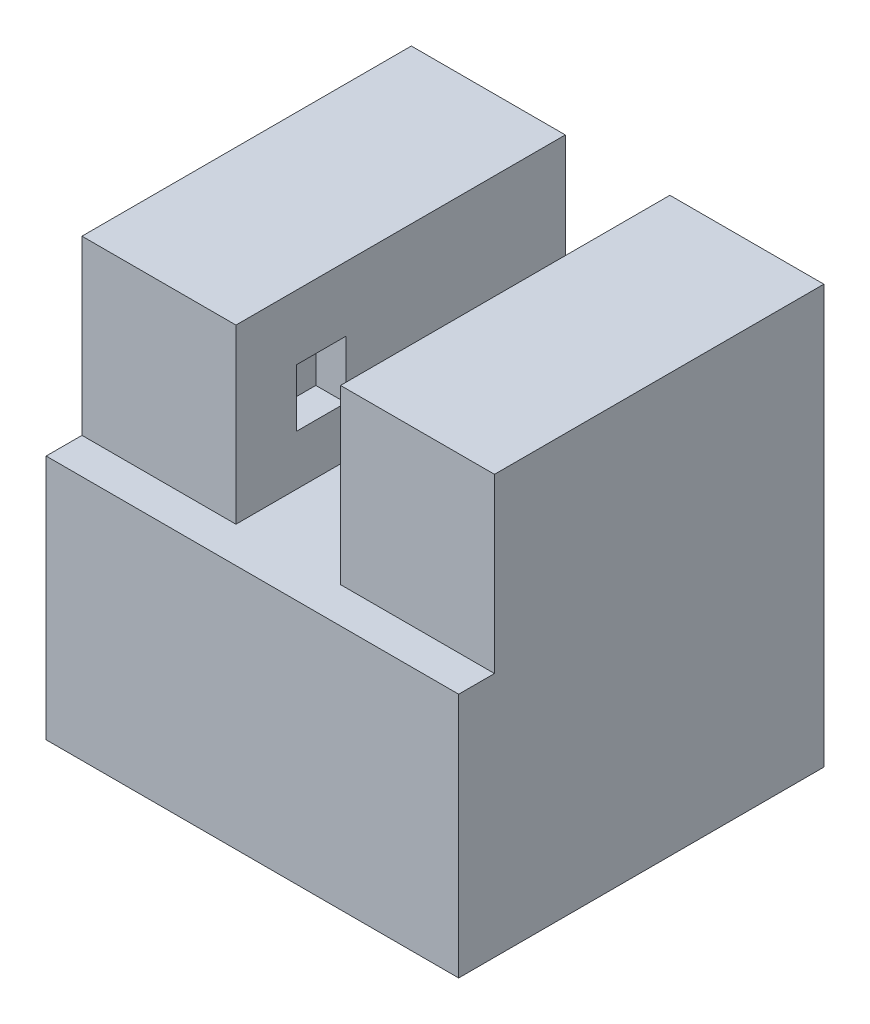
ISO-10303-21;
HEADER;
FILE_DESCRIPTION(('STEP AP214'),'2;1');
FILE_NAME('part.step','',(''),(''),'','','');
FILE_SCHEMA(('AUTOMOTIVE_DESIGN { 1 0 10303 214 1 1 1 1 }'));
ENDSEC;
DATA;
#1=APPLICATION_CONTEXT('core data for automotive mechanical design processes');
#2=APPLICATION_PROTOCOL_DEFINITION('international standard','automotive_design',2000,#1);
#3=PRODUCT_CONTEXT('',#1,'mechanical');
#4=PRODUCT('Part','Part','',(#3));
#5=PRODUCT_RELATED_PRODUCT_CATEGORY('part','',(#4));
#6=PRODUCT_DEFINITION_FORMATION('','',#4);
#7=PRODUCT_DEFINITION_CONTEXT('part definition',#1,'design');
#8=PRODUCT_DEFINITION('design','',#6,#7);
#9=PRODUCT_DEFINITION_SHAPE('','',#8);
#10=(LENGTH_UNIT() NAMED_UNIT(*) SI_UNIT(.MILLI.,.METRE.));
#11=(NAMED_UNIT(*) PLANE_ANGLE_UNIT() SI_UNIT($,.RADIAN.));
#12=(NAMED_UNIT(*) SI_UNIT($,.STERADIAN.) SOLID_ANGLE_UNIT());
#13=UNCERTAINTY_MEASURE_WITH_UNIT(LENGTH_MEASURE(1.E-05),#10,'distance_accuracy_value','');
#14=(GEOMETRIC_REPRESENTATION_CONTEXT(3) GLOBAL_UNCERTAINTY_ASSIGNED_CONTEXT((#13)) GLOBAL_UNIT_ASSIGNED_CONTEXT((#10,
#11,#12)) REPRESENTATION_CONTEXT('',''));
#15=CARTESIAN_POINT('',(0.,0.,0.));
#16=DIRECTION('',(0.,0.,1.));
#17=DIRECTION('',(1.,0.,0.));
#18=AXIS2_PLACEMENT_3D('',#15,#16,#17);
#19=CARTESIAN_POINT('',(-9.35,25.4,10.));
#20=DIRECTION('',(0.,0.,-1.));
#21=DIRECTION('',(-1.,0.,0.));
#22=AXIS2_PLACEMENT_3D('',#19,#20,#21);
#23=PLANE('',#22);
#24=DIRECTION('',(0.,-1.,0.));
#25=VECTOR('',#24,1.);
#26=CARTESIAN_POINT('',(-12.525,25.4,10.));
#27=LINE('',#26,#25);
#28=CARTESIAN_POINT('',(-12.525,25.4,10.));
#29=VERTEX_POINT('',#28);
#30=CARTESIAN_POINT('',(-12.525,14.925,10.));
#31=VERTEX_POINT('',#30);
#32=EDGE_CURVE('E403',#29,#31,#27,.T.);
#33=ORIENTED_EDGE('',*,*,#32,.T.);
#34=DIRECTION('',(1.,0.,0.));
#35=VECTOR('',#34,1.);
#36=CARTESIAN_POINT('',(-27.6076473140493,14.925,10.));
#37=LINE('',#36,#35);
#38=CARTESIAN_POINT('',(-3.175,14.925,10.));
#39=VERTEX_POINT('',#38);
#40=EDGE_CURVE('E44',#31,#39,#37,.T.);
#41=ORIENTED_EDGE('',*,*,#40,.T.);
#42=DIRECTION('',(0.,-1.,0.));
#43=VECTOR('',#42,1.);
#44=CARTESIAN_POINT('',(-3.175,0.,10.));
#45=LINE('',#44,#43);
#46=CARTESIAN_POINT('',(-3.175,25.4,10.));
#47=VERTEX_POINT('',#46);
#48=EDGE_CURVE('E423',#47,#39,#45,.T.);
#49=ORIENTED_EDGE('',*,*,#48,.F.);
#50=DIRECTION('',(1.,0.,0.));
#51=VECTOR('',#50,1.);
#52=CARTESIAN_POINT('',(-9.35,25.4,10.));
#53=LINE('',#52,#51);
#54=EDGE_CURVE('E446',#29,#47,#53,.T.);
#55=ORIENTED_EDGE('',*,*,#54,.F.);
#56=EDGE_LOOP('',(#33,#41,#49,#55));
#57=FACE_BOUND('',#56,.T.);
#58=ADVANCED_FACE('F33',(#57),#23,.F.);
#59=CARTESIAN_POINT('',(0.,0.,6.825));
#60=DIRECTION('',(0.,0.,-1.));
#61=DIRECTION('',(-1.,0.,0.));
#62=AXIS2_PLACEMENT_3D('',#59,#60,#61);
#63=PLANE('',#62);
#64=DIRECTION('',(1.,0.,0.));
#65=VECTOR('',#64,1.);
#66=CARTESIAN_POINT('',(0.,10.125,6.825));
#67=LINE('',#66,#65);
#68=CARTESIAN_POINT('',(-9.35,10.125,6.825));
#69=VERTEX_POINT('',#68);
#70=CARTESIAN_POINT('',(-5.,10.125,6.825));
#71=VERTEX_POINT('',#70);
#72=EDGE_CURVE('E42',#69,#71,#67,.T.);
#73=ORIENTED_EDGE('',*,*,#72,.F.);
#74=DIRECTION('',(0.,1.,0.));
#75=VECTOR('',#74,1.);
#76=CARTESIAN_POINT('',(-9.35,0.,6.825));
#77=LINE('',#76,#75);
#78=CARTESIAN_POINT('',(-9.35,22.225,6.825));
#79=VERTEX_POINT('',#78);
#80=EDGE_CURVE('E366',#69,#79,#77,.T.);
#81=ORIENTED_EDGE('',*,*,#80,.T.);
#82=DIRECTION('',(1.,0.,0.));
#83=VECTOR('',#82,1.);
#84=CARTESIAN_POINT('',(0.,22.225,6.825));
#85=LINE('',#84,#83);
#86=CARTESIAN_POINT('',(-5.,22.225,6.825));
#87=VERTEX_POINT('',#86);
#88=EDGE_CURVE('E368',#79,#87,#85,.T.);
#89=ORIENTED_EDGE('',*,*,#88,.T.);
#90=DIRECTION('',(0.,1.,0.));
#91=VECTOR('',#90,1.);
#92=CARTESIAN_POINT('',(-5.,0.,6.825));
#93=LINE('',#92,#91);
#94=EDGE_CURVE('E355',#71,#87,#93,.T.);
#95=ORIENTED_EDGE('',*,*,#94,.F.);
#96=EDGE_LOOP('',(#73,#81,#89,#95));
#97=FACE_BOUND('',#96,.T.);
#98=ADVANCED_FACE('F528',(#97),#63,.T.);
#99=DIRECTION('',(0.,-1.,0.));
#100=VECTOR('',#99,1.);
#101=CARTESIAN_POINT('',(3.175,0.,10.));
#102=LINE('',#101,#100);
#103=CARTESIAN_POINT('',(3.175,25.4,10.));
#104=VERTEX_POINT('',#103);
#105=CARTESIAN_POINT('',(3.175,14.925,10.));
#106=VERTEX_POINT('',#105);
#107=EDGE_CURVE('E426',#104,#106,#102,.T.);
#108=ORIENTED_EDGE('',*,*,#107,.T.);
#109=CARTESIAN_POINT('',(12.525,14.925,10.));
#110=VERTEX_POINT('',#109);
#111=EDGE_CURVE('E11',#106,#110,#37,.T.);
#112=ORIENTED_EDGE('',*,*,#111,.T.);
#113=DIRECTION('',(0.,1.,0.));
#114=VECTOR('',#113,1.);
#115=CARTESIAN_POINT('',(12.525,25.4,10.));
#116=LINE('',#115,#114);
#117=CARTESIAN_POINT('',(12.525,25.4,10.));
#118=VERTEX_POINT('',#117);
#119=EDGE_CURVE('E412',#110,#118,#116,.T.);
#120=ORIENTED_EDGE('',*,*,#119,.T.);
#121=EDGE_CURVE('E450',#104,#118,#53,.T.);
#122=ORIENTED_EDGE('',*,*,#121,.F.);
#123=EDGE_LOOP('',(#108,#112,#120,#122));
#124=FACE_BOUND('',#123,.T.);
#125=ADVANCED_FACE('F35',(#124),#23,.F.);
#126=CARTESIAN_POINT('',(-9.35,25.4,-10.));
#127=DIRECTION('',(0.,0.,1.));
#128=DIRECTION('',(1.,0.,0.));
#129=AXIS2_PLACEMENT_3D('',#126,#127,#128);
#130=PLANE('',#129);
#131=DIRECTION('',(-1.,0.,0.));
#132=VECTOR('',#131,1.);
#133=CARTESIAN_POINT('',(-9.35,0.,-10.));
#134=LINE('',#133,#132);
#135=CARTESIAN_POINT('',(12.525,0.,-10.));
#136=VERTEX_POINT('',#135);
#137=CARTESIAN_POINT('',(11.,0.,-10.));
#138=VERTEX_POINT('',#137);
#139=EDGE_CURVE('E453',#136,#138,#134,.T.);
#140=ORIENTED_EDGE('',*,*,#139,.T.);
#141=DIRECTION('',(0.,-1.,0.));
#142=VECTOR('',#141,1.);
#143=CARTESIAN_POINT('',(11.,10.125,-10.));
#144=LINE('',#143,#142);
#145=CARTESIAN_POINT('',(11.,10.125,-10.));
#146=VERTEX_POINT('',#145);
#147=EDGE_CURVE('E261',#146,#138,#144,.T.);
#148=ORIENTED_EDGE('',*,*,#147,.F.);
#149=DIRECTION('',(1.,0.,0.));
#150=VECTOR('',#149,1.);
#151=CARTESIAN_POINT('',(11.,10.125,-10.));
#152=LINE('',#151,#150);
#153=CARTESIAN_POINT('',(9.35,10.125,-10.));
#154=VERTEX_POINT('',#153);
#155=EDGE_CURVE('E280',#154,#146,#152,.T.);
#156=ORIENTED_EDGE('',*,*,#155,.F.);
#157=DIRECTION('',(0.,-1.,0.));
#158=VECTOR('',#157,1.);
#159=CARTESIAN_POINT('',(9.35,0.,-10.));
#160=LINE('',#159,#158);
#161=CARTESIAN_POINT('',(9.35,22.225,-10.));
#162=VERTEX_POINT('',#161);
#163=EDGE_CURVE('E383',#162,#154,#160,.T.);
#164=ORIENTED_EDGE('',*,*,#163,.F.);
#165=DIRECTION('',(-1.,0.,0.));
#166=VECTOR('',#165,1.);
#167=CARTESIAN_POINT('',(0.,22.225,-10.));
#168=LINE('',#167,#166);
#169=CARTESIAN_POINT('',(5.,22.225,-10.));
#170=VERTEX_POINT('',#169);
#171=EDGE_CURVE('E380',#162,#170,#168,.T.);
#172=ORIENTED_EDGE('',*,*,#171,.T.);
#173=DIRECTION('',(0.,-1.,0.));
#174=VECTOR('',#173,1.);
#175=CARTESIAN_POINT('',(5.,0.,-10.));
#176=LINE('',#175,#174);
#177=CARTESIAN_POINT('',(5.,10.125,-10.));
#178=VERTEX_POINT('',#177);
#179=EDGE_CURVE('E377',#170,#178,#176,.T.);
#180=ORIENTED_EDGE('',*,*,#179,.T.);
#181=DIRECTION('',(-1.,0.,0.));
#182=VECTOR('',#181,1.);
#183=CARTESIAN_POINT('',(0.,10.125,-10.));
#184=LINE('',#183,#182);
#185=CARTESIAN_POINT('',(-5.,10.125,-10.));
#186=VERTEX_POINT('',#185);
#187=EDGE_CURVE('E374',#178,#186,#184,.T.);
#188=ORIENTED_EDGE('',*,*,#187,.T.);
#189=DIRECTION('',(0.,1.,0.));
#190=VECTOR('',#189,1.);
#191=CARTESIAN_POINT('',(-5.,0.,-10.));
#192=LINE('',#191,#190);
#193=CARTESIAN_POINT('',(-5.,22.225,-10.));
#194=VERTEX_POINT('',#193);
#195=EDGE_CURVE('E354',#186,#194,#192,.T.);
#196=ORIENTED_EDGE('',*,*,#195,.T.);
#197=DIRECTION('',(1.,0.,0.));
#198=VECTOR('',#197,1.);
#199=CARTESIAN_POINT('',(0.,22.225,-10.));
#200=LINE('',#199,#198);
#201=CARTESIAN_POINT('',(-9.35,22.225,-10.));
#202=VERTEX_POINT('',#201);
#203=EDGE_CURVE('E358',#202,#194,#200,.T.);
#204=ORIENTED_EDGE('',*,*,#203,.F.);
#205=DIRECTION('',(0.,1.,0.));
#206=VECTOR('',#205,1.);
#207=CARTESIAN_POINT('',(-9.35,0.,-10.));
#208=LINE('',#207,#206);
#209=CARTESIAN_POINT('',(-9.35,10.125,-10.));
#210=VERTEX_POINT('',#209);
#211=EDGE_CURVE('E386',#210,#202,#208,.T.);
#212=ORIENTED_EDGE('',*,*,#211,.F.);
#213=CARTESIAN_POINT('',(-11.,10.125,-10.));
#214=VERTEX_POINT('',#213);
#215=EDGE_CURVE('E266',#214,#210,#152,.T.);
#216=ORIENTED_EDGE('',*,*,#215,.F.);
#217=DIRECTION('',(0.,1.,0.));
#218=VECTOR('',#217,1.);
#219=CARTESIAN_POINT('',(-11.,10.125,-10.));
#220=LINE('',#219,#218);
#221=CARTESIAN_POINT('',(-11.,0.,-10.));
#222=VERTEX_POINT('',#221);
#223=EDGE_CURVE('E277',#222,#214,#220,.T.);
#224=ORIENTED_EDGE('',*,*,#223,.F.);
#225=CARTESIAN_POINT('',(-12.525,0.,-10.));
#226=VERTEX_POINT('',#225);
#227=EDGE_CURVE('E439',#222,#226,#134,.T.);
#228=ORIENTED_EDGE('',*,*,#227,.T.);
#229=DIRECTION('',(0.,1.,0.));
#230=VECTOR('',#229,1.);
#231=CARTESIAN_POINT('',(-12.525,25.4,-10.));
#232=LINE('',#231,#230);
#233=CARTESIAN_POINT('',(-12.525,25.4,-10.));
#234=VERTEX_POINT('',#233);
#235=EDGE_CURVE('E392',#226,#234,#232,.T.);
#236=ORIENTED_EDGE('',*,*,#235,.T.);
#237=DIRECTION('',(-1.,0.,0.));
#238=VECTOR('',#237,1.);
#239=CARTESIAN_POINT('',(-9.35,25.4,-10.));
#240=LINE('',#239,#238);
#241=CARTESIAN_POINT('',(-3.175,25.4,-10.));
#242=VERTEX_POINT('',#241);
#243=EDGE_CURVE('E449',#242,#234,#240,.T.);
#244=ORIENTED_EDGE('',*,*,#243,.F.);
#245=DIRECTION('',(0.,-1.,0.));
#246=VECTOR('',#245,1.);
#247=CARTESIAN_POINT('',(-3.175,0.,-10.));
#248=LINE('',#247,#246);
#249=CARTESIAN_POINT('',(-3.175,14.925,-10.));
#250=VERTEX_POINT('',#249);
#251=EDGE_CURVE('E414',#242,#250,#248,.T.);
#252=ORIENTED_EDGE('',*,*,#251,.T.);
#253=DIRECTION('',(-1.,0.,0.));
#254=VECTOR('',#253,1.);
#255=CARTESIAN_POINT('',(0.,14.925,-10.));
#256=LINE('',#255,#254);
#257=CARTESIAN_POINT('',(3.175,14.925,-10.));
#258=VERTEX_POINT('',#257);
#259=EDGE_CURVE('E427',#258,#250,#256,.T.);
#260=ORIENTED_EDGE('',*,*,#259,.F.);
#261=DIRECTION('',(0.,-1.,0.));
#262=VECTOR('',#261,1.);
#263=CARTESIAN_POINT('',(3.175,0.,-10.));
#264=LINE('',#263,#262);
#265=CARTESIAN_POINT('',(3.175,25.4,-10.));
#266=VERTEX_POINT('',#265);
#267=EDGE_CURVE('E433',#266,#258,#264,.T.);
#268=ORIENTED_EDGE('',*,*,#267,.F.);
#269=CARTESIAN_POINT('',(12.525,25.4,-10.));
#270=VERTEX_POINT('',#269);
#271=EDGE_CURVE('E451',#270,#266,#240,.T.);
#272=ORIENTED_EDGE('',*,*,#271,.F.);
#273=DIRECTION('',(0.,-1.,0.));
#274=VECTOR('',#273,1.);
#275=CARTESIAN_POINT('',(12.525,25.4,-10.));
#276=LINE('',#275,#274);
#277=EDGE_CURVE('E405',#270,#136,#276,.T.);
#278=ORIENTED_EDGE('',*,*,#277,.T.);
#279=EDGE_LOOP('',(#140,#148,#156,#164,#172,#180,#188,#196,#204,#212,#216,#224,#228,#236,#244,
#252,#260,#268,#272,#278));
#280=FACE_BOUND('',#279,.T.);
#281=ADVANCED_FACE('F460',(#280),#130,.F.);
#282=CARTESIAN_POINT('',(0.,25.4,0.));
#283=DIRECTION('',(0.,1.,0.));
#284=DIRECTION('',(0.,0.,1.));
#285=AXIS2_PLACEMENT_3D('',#282,#283,#284);
#286=PLANE('',#285);
#287=ORIENTED_EDGE('',*,*,#54,.T.);
#288=DIRECTION('',(0.,0.,-1.));
#289=VECTOR('',#288,1.);
#290=CARTESIAN_POINT('',(-3.175,25.4,10.));
#291=LINE('',#290,#289);
#292=EDGE_CURVE('E430',#47,#242,#291,.T.);
#293=ORIENTED_EDGE('',*,*,#292,.T.);
#294=ORIENTED_EDGE('',*,*,#243,.T.);
#295=DIRECTION('',(0.,0.,-1.));
#296=VECTOR('',#295,1.);
#297=CARTESIAN_POINT('',(-12.525,25.4,35.5976683508479));
#298=LINE('',#297,#296);
#299=EDGE_CURVE('E406',#29,#234,#298,.T.);
#300=ORIENTED_EDGE('',*,*,#299,.F.);
#301=EDGE_LOOP('',(#287,#293,#294,#300));
#302=FACE_BOUND('',#301,.T.);
#303=ADVANCED_FACE('F469',(#302),#286,.T.);
#304=DIRECTION('',(0.,0.,-1.));
#305=VECTOR('',#304,1.);
#306=CARTESIAN_POINT('',(3.175,25.4,10.));
#307=LINE('',#306,#305);
#308=EDGE_CURVE('E442',#104,#266,#307,.T.);
#309=ORIENTED_EDGE('',*,*,#308,.F.);
#310=ORIENTED_EDGE('',*,*,#121,.T.);
#311=DIRECTION('',(0.,0.,-1.));
#312=VECTOR('',#311,1.);
#313=CARTESIAN_POINT('',(12.525,25.4,35.5976683508479));
#314=LINE('',#313,#312);
#315=EDGE_CURVE('E418',#118,#270,#314,.T.);
#316=ORIENTED_EDGE('',*,*,#315,.T.);
#317=ORIENTED_EDGE('',*,*,#271,.T.);
#318=EDGE_LOOP('',(#309,#310,#316,#317));
#319=FACE_BOUND('',#318,.T.);
#320=ADVANCED_FACE('F480',(#319),#286,.T.);
#321=CARTESIAN_POINT('',(0.,0.,0.));
#322=DIRECTION('',(0.,1.,0.));
#323=DIRECTION('',(0.,0.,1.));
#324=AXIS2_PLACEMENT_3D('',#321,#322,#323);
#325=PLANE('',#324);
#326=DIRECTION('',(-1.,0.,0.));
#327=VECTOR('',#326,1.);
#328=CARTESIAN_POINT('',(11.,0.,9.));
#329=LINE('',#328,#327);
#330=CARTESIAN_POINT('',(11.,0.,9.));
#331=VERTEX_POINT('',#330);
#332=CARTESIAN_POINT('',(-11.,0.,9.));
#333=VERTEX_POINT('',#332);
#334=EDGE_CURVE('E265',#331,#333,#329,.T.);
#335=ORIENTED_EDGE('',*,*,#334,.F.);
#336=DIRECTION('',(0.,0.,-1.));
#337=VECTOR('',#336,1.);
#338=CARTESIAN_POINT('',(11.,0.,9.));
#339=LINE('',#338,#337);
#340=EDGE_CURVE('E275',#331,#138,#339,.T.);
#341=ORIENTED_EDGE('',*,*,#340,.T.);
#342=ORIENTED_EDGE('',*,*,#139,.F.);
#343=DIRECTION('',(0.,0.,-1.));
#344=VECTOR('',#343,1.);
#345=CARTESIAN_POINT('',(12.525,0.,35.5976683508479));
#346=LINE('',#345,#344);
#347=CARTESIAN_POINT('',(12.525,0.,12.175));
#348=VERTEX_POINT('',#347);
#349=EDGE_CURVE('E415',#348,#136,#346,.T.);
#350=ORIENTED_EDGE('',*,*,#349,.F.);
#351=DIRECTION('',(1.,0.,0.));
#352=VECTOR('',#351,1.);
#353=CARTESIAN_POINT('',(-27.6076473140494,0.,12.175));
#354=LINE('',#353,#352);
#355=CARTESIAN_POINT('',(-12.525,0.,12.175));
#356=VERTEX_POINT('',#355);
#357=EDGE_CURVE('E244',#356,#348,#354,.T.);
#358=ORIENTED_EDGE('',*,*,#357,.F.);
#359=DIRECTION('',(0.,0.,-1.));
#360=VECTOR('',#359,1.);
#361=CARTESIAN_POINT('',(-12.525,0.,35.5976683508479));
#362=LINE('',#361,#360);
#363=EDGE_CURVE('E240',#356,#226,#362,.T.);
#364=ORIENTED_EDGE('',*,*,#363,.T.);
#365=ORIENTED_EDGE('',*,*,#227,.F.);
#366=DIRECTION('',(0.,0.,-1.));
#367=VECTOR('',#366,1.);
#368=CARTESIAN_POINT('',(-11.,0.,9.));
#369=LINE('',#368,#367);
#370=EDGE_CURVE('E288',#333,#222,#369,.T.);
#371=ORIENTED_EDGE('',*,*,#370,.F.);
#372=EDGE_LOOP('',(#335,#341,#342,#350,#358,#364,#365,#371));
#373=FACE_BOUND('',#372,.T.);
#374=ADVANCED_FACE('F466',(#373),#325,.F.);
#375=CARTESIAN_POINT('',(-3.175,0.,10.));
#376=DIRECTION('',(1.,0.,0.));
#377=DIRECTION('',(0.,1.,0.));
#378=AXIS2_PLACEMENT_3D('',#375,#376,#377);
#379=PLANE('',#378);
#380=DIRECTION('',(0.,0.,-1.));
#381=VECTOR('',#380,1.);
#382=CARTESIAN_POINT('',(-3.175,17.975,10.));
#383=LINE('',#382,#381);
#384=CARTESIAN_POINT('',(-3.175,17.975,6.325));
#385=VERTEX_POINT('',#384);
#386=CARTESIAN_POINT('',(-3.175,17.975,3.325));
#387=VERTEX_POINT('',#386);
#388=EDGE_CURVE('E352',#385,#387,#383,.T.);
#389=ORIENTED_EDGE('',*,*,#388,.F.);
#390=DIRECTION('',(0.,-1.,0.));
#391=VECTOR('',#390,1.);
#392=CARTESIAN_POINT('',(-3.175,0.,6.325));
#393=LINE('',#392,#391);
#394=CARTESIAN_POINT('',(-3.175,21.475,6.325));
#395=VERTEX_POINT('',#394);
#396=EDGE_CURVE('E337',#395,#385,#393,.T.);
#397=ORIENTED_EDGE('',*,*,#396,.F.);
#398=DIRECTION('',(0.,0.,1.));
#399=VECTOR('',#398,1.);
#400=CARTESIAN_POINT('',(-3.175,21.475,10.));
#401=LINE('',#400,#399);
#402=CARTESIAN_POINT('',(-3.175,21.475,3.325));
#403=VERTEX_POINT('',#402);
#404=EDGE_CURVE('E342',#403,#395,#401,.T.);
#405=ORIENTED_EDGE('',*,*,#404,.F.);
#406=DIRECTION('',(0.,1.,0.));
#407=VECTOR('',#406,1.);
#408=CARTESIAN_POINT('',(-3.175,0.,3.32500000000001));
#409=LINE('',#408,#407);
#410=EDGE_CURVE('E347',#387,#403,#409,.T.);
#411=ORIENTED_EDGE('',*,*,#410,.F.);
#412=EDGE_LOOP('',(#389,#397,#405,#411));
#413=FACE_BOUND('',#412,.T.);
#414=ORIENTED_EDGE('',*,*,#251,.F.);
#415=ORIENTED_EDGE('',*,*,#292,.F.);
#416=ORIENTED_EDGE('',*,*,#48,.T.);
#417=DIRECTION('',(0.,0.,-1.));
#418=VECTOR('',#417,1.);
#419=CARTESIAN_POINT('',(-3.175,14.925,10.));
#420=LINE('',#419,#418);
#421=EDGE_CURVE('E437',#39,#250,#420,.T.);
#422=ORIENTED_EDGE('',*,*,#421,.T.);
#423=EDGE_LOOP('',(#414,#415,#416,#422));
#424=FACE_BOUND('',#423,.T.);
#425=ADVANCED_FACE('F473',(#413,#424),#379,.T.);
#426=CARTESIAN_POINT('',(0.,14.925,10.));
#427=DIRECTION('',(0.,-1.,0.));
#428=DIRECTION('',(0.,0.,-1.));
#429=AXIS2_PLACEMENT_3D('',#426,#427,#428);
#430=PLANE('',#429);
#431=ORIENTED_EDGE('',*,*,#259,.T.);
#432=ORIENTED_EDGE('',*,*,#421,.F.);
#433=ORIENTED_EDGE('',*,*,#40,.F.);
#434=DIRECTION('',(0.,0.,1.));
#435=VECTOR('',#434,1.);
#436=CARTESIAN_POINT('',(-12.525,14.925,10.));
#437=LINE('',#436,#435);
#438=CARTESIAN_POINT('',(-12.525,14.925,12.175));
#439=VERTEX_POINT('',#438);
#440=EDGE_CURVE('E236',#31,#439,#437,.T.);
#441=ORIENTED_EDGE('',*,*,#440,.T.);
#442=DIRECTION('',(1.,0.,0.));
#443=VECTOR('',#442,1.);
#444=CARTESIAN_POINT('',(-27.6076473140493,14.925,12.175));
#445=LINE('',#444,#443);
#446=CARTESIAN_POINT('',(12.525,14.925,12.175));
#447=VERTEX_POINT('',#446);
#448=EDGE_CURVE('E245',#439,#447,#445,.T.);
#449=ORIENTED_EDGE('',*,*,#448,.T.);
#450=DIRECTION('',(0.,0.,1.));
#451=VECTOR('',#450,1.);
#452=CARTESIAN_POINT('',(12.525,14.925,10.));
#453=LINE('',#452,#451);
#454=EDGE_CURVE('E51',#110,#447,#453,.T.);
#455=ORIENTED_EDGE('',*,*,#454,.F.);
#456=ORIENTED_EDGE('',*,*,#111,.F.);
#457=DIRECTION('',(0.,0.,-1.));
#458=VECTOR('',#457,1.);
#459=CARTESIAN_POINT('',(3.175,14.925,10.));
#460=LINE('',#459,#458);
#461=EDGE_CURVE('E440',#106,#258,#460,.T.);
#462=ORIENTED_EDGE('',*,*,#461,.T.);
#463=EDGE_LOOP('',(#431,#432,#433,#441,#449,#455,#456,#462));
#464=FACE_BOUND('',#463,.T.);
#465=ADVANCED_FACE('F253',(#464),#430,.F.);
#466=CARTESIAN_POINT('',(3.175,0.,10.));
#467=DIRECTION('',(1.,0.,0.));
#468=DIRECTION('',(0.,1.,0.));
#469=AXIS2_PLACEMENT_3D('',#466,#467,#468);
#470=PLANE('',#469);
#471=DIRECTION('',(0.,-1.,0.));
#472=VECTOR('',#471,1.);
#473=CARTESIAN_POINT('',(3.175,0.,6.325));
#474=LINE('',#473,#472);
#475=CARTESIAN_POINT('',(3.175,21.475,6.325));
#476=VERTEX_POINT('',#475);
#477=CARTESIAN_POINT('',(3.175,17.975,6.325));
#478=VERTEX_POINT('',#477);
#479=EDGE_CURVE('E334',#476,#478,#474,.T.);
#480=ORIENTED_EDGE('',*,*,#479,.T.);
#481=DIRECTION('',(0.,0.,-1.));
#482=VECTOR('',#481,1.);
#483=CARTESIAN_POINT('',(3.175,17.975,10.));
#484=LINE('',#483,#482);
#485=CARTESIAN_POINT('',(3.175,17.975,3.325));
#486=VERTEX_POINT('',#485);
#487=EDGE_CURVE('E349',#478,#486,#484,.T.);
#488=ORIENTED_EDGE('',*,*,#487,.T.);
#489=DIRECTION('',(0.,1.,0.));
#490=VECTOR('',#489,1.);
#491=CARTESIAN_POINT('',(3.175,0.,3.32500000000001));
#492=LINE('',#491,#490);
#493=CARTESIAN_POINT('',(3.175,21.475,3.325));
#494=VERTEX_POINT('',#493);
#495=EDGE_CURVE('E344',#486,#494,#492,.T.);
#496=ORIENTED_EDGE('',*,*,#495,.T.);
#497=DIRECTION('',(0.,0.,1.));
#498=VECTOR('',#497,1.);
#499=CARTESIAN_POINT('',(3.175,21.475,10.));
#500=LINE('',#499,#498);
#501=EDGE_CURVE('E339',#494,#476,#500,.T.);
#502=ORIENTED_EDGE('',*,*,#501,.T.);
#503=EDGE_LOOP('',(#480,#488,#496,#502));
#504=FACE_BOUND('',#503,.T.);
#505=ORIENTED_EDGE('',*,*,#267,.T.);
#506=ORIENTED_EDGE('',*,*,#461,.F.);
#507=ORIENTED_EDGE('',*,*,#107,.F.);
#508=ORIENTED_EDGE('',*,*,#308,.T.);
#509=EDGE_LOOP('',(#505,#506,#507,#508));
#510=FACE_BOUND('',#509,.T.);
#511=ADVANCED_FACE('F477',(#504,#510),#470,.F.);
#512=CARTESIAN_POINT('',(12.525,25.4,35.5976683508479));
#513=DIRECTION('',(1.,0.,0.));
#514=DIRECTION('',(0.,1.,0.));
#515=AXIS2_PLACEMENT_3D('',#512,#513,#514);
#516=PLANE('',#515);
#517=ORIENTED_EDGE('',*,*,#119,.F.);
#518=ORIENTED_EDGE('',*,*,#454,.T.);
#519=DIRECTION('',(0.,-1.,0.));
#520=VECTOR('',#519,1.);
#521=CARTESIAN_POINT('',(12.525,14.925,12.175));
#522=LINE('',#521,#520);
#523=EDGE_CURVE('E250',#447,#348,#522,.T.);
#524=ORIENTED_EDGE('',*,*,#523,.T.);
#525=ORIENTED_EDGE('',*,*,#349,.T.);
#526=ORIENTED_EDGE('',*,*,#277,.F.);
#527=ORIENTED_EDGE('',*,*,#315,.F.);
#528=EDGE_LOOP('',(#517,#518,#524,#525,#526,#527));
#529=FACE_BOUND('',#528,.T.);
#530=ADVANCED_FACE('F486',(#529),#516,.T.);
#531=CARTESIAN_POINT('',(-12.525,25.4,35.5976683508479));
#532=DIRECTION('',(-1.,0.,0.));
#533=DIRECTION('',(0.,-1.,0.));
#534=AXIS2_PLACEMENT_3D('',#531,#532,#533);
#535=PLANE('',#534);
#536=ORIENTED_EDGE('',*,*,#32,.F.);
#537=ORIENTED_EDGE('',*,*,#299,.T.);
#538=ORIENTED_EDGE('',*,*,#235,.F.);
#539=ORIENTED_EDGE('',*,*,#363,.F.);
#540=DIRECTION('',(0.,-1.,0.));
#541=VECTOR('',#540,1.);
#542=CARTESIAN_POINT('',(-12.525,14.925,12.175));
#543=LINE('',#542,#541);
#544=EDGE_CURVE('E231',#439,#356,#543,.T.);
#545=ORIENTED_EDGE('',*,*,#544,.F.);
#546=ORIENTED_EDGE('',*,*,#440,.F.);
#547=EDGE_LOOP('',(#536,#537,#538,#539,#545,#546));
#548=FACE_BOUND('',#547,.T.);
#549=ADVANCED_FACE('F234',(#548),#535,.T.);
#550=CARTESIAN_POINT('',(-5.,0.,6.825));
#551=DIRECTION('',(-1.,0.,0.));
#552=DIRECTION('',(0.,-1.,0.));
#553=AXIS2_PLACEMENT_3D('',#550,#551,#552);
#554=PLANE('',#553);
#555=DIRECTION('',(0.,0.,-1.));
#556=VECTOR('',#555,1.);
#557=CARTESIAN_POINT('',(-5.,17.975,6.325));
#558=LINE('',#557,#556);
#559=CARTESIAN_POINT('',(-5.,17.975,6.325));
#560=VERTEX_POINT('',#559);
#561=CARTESIAN_POINT('',(-5.,17.975,3.325));
#562=VERTEX_POINT('',#561);
#563=EDGE_CURVE('E300',#560,#562,#558,.T.);
#564=ORIENTED_EDGE('',*,*,#563,.T.);
#565=DIRECTION('',(0.,1.,0.));
#566=VECTOR('',#565,1.);
#567=CARTESIAN_POINT('',(-5.,21.475,3.325));
#568=LINE('',#567,#566);
#569=CARTESIAN_POINT('',(-5.,21.475,3.325));
#570=VERTEX_POINT('',#569);
#571=EDGE_CURVE('E321',#562,#570,#568,.T.);
#572=ORIENTED_EDGE('',*,*,#571,.T.);
#573=DIRECTION('',(0.,0.,1.));
#574=VECTOR('',#573,1.);
#575=CARTESIAN_POINT('',(-5.,21.475,6.325));
#576=LINE('',#575,#574);
#577=CARTESIAN_POINT('',(-5.,21.475,6.325));
#578=VERTEX_POINT('',#577);
#579=EDGE_CURVE('E316',#570,#578,#576,.T.);
#580=ORIENTED_EDGE('',*,*,#579,.T.);
#581=DIRECTION('',(0.,-1.,0.));
#582=VECTOR('',#581,1.);
#583=CARTESIAN_POINT('',(-5.,21.475,6.325));
#584=LINE('',#583,#582);
#585=EDGE_CURVE('E312',#578,#560,#584,.T.);
#586=ORIENTED_EDGE('',*,*,#585,.T.);
#587=EDGE_LOOP('',(#564,#572,#580,#586));
#588=FACE_BOUND('',#587,.T.);
#589=ORIENTED_EDGE('',*,*,#195,.F.);
#590=DIRECTION('',(0.,0.,-1.));
#591=VECTOR('',#590,1.);
#592=CARTESIAN_POINT('',(-5.,10.125,6.825));
#593=LINE('',#592,#591);
#594=EDGE_CURVE('E371',#71,#186,#593,.T.);
#595=ORIENTED_EDGE('',*,*,#594,.F.);
#596=ORIENTED_EDGE('',*,*,#94,.T.);
#597=DIRECTION('',(0.,0.,-1.));
#598=VECTOR('',#597,1.);
#599=CARTESIAN_POINT('',(-5.,22.225,6.825));
#600=LINE('',#599,#598);
#601=EDGE_CURVE('E390',#87,#194,#600,.T.);
#602=ORIENTED_EDGE('',*,*,#601,.T.);
#603=EDGE_LOOP('',(#589,#595,#596,#602));
#604=FACE_BOUND('',#603,.T.);
#605=ADVANCED_FACE('F516',(#588,#604),#554,.T.);
#606=CARTESIAN_POINT('',(0.,22.225,6.825));
#607=DIRECTION('',(0.,1.,0.));
#608=DIRECTION('',(0.,0.,1.));
#609=AXIS2_PLACEMENT_3D('',#606,#607,#608);
#610=PLANE('',#609);
#611=ORIENTED_EDGE('',*,*,#203,.T.);
#612=ORIENTED_EDGE('',*,*,#601,.F.);
#613=ORIENTED_EDGE('',*,*,#88,.F.);
#614=DIRECTION('',(0.,0.,-1.));
#615=VECTOR('',#614,1.);
#616=CARTESIAN_POINT('',(-9.35,22.225,6.825));
#617=LINE('',#616,#615);
#618=EDGE_CURVE('E393',#79,#202,#617,.T.);
#619=ORIENTED_EDGE('',*,*,#618,.T.);
#620=EDGE_LOOP('',(#611,#612,#613,#619));
#621=FACE_BOUND('',#620,.T.);
#622=ADVANCED_FACE('F521',(#621),#610,.F.);
#623=CARTESIAN_POINT('',(-9.35,0.,6.825));
#624=DIRECTION('',(-1.,0.,0.));
#625=DIRECTION('',(0.,-1.,0.));
#626=AXIS2_PLACEMENT_3D('',#623,#624,#625);
#627=PLANE('',#626);
#628=ORIENTED_EDGE('',*,*,#80,.F.);
#629=DIRECTION('',(0.,0.,-1.));
#630=VECTOR('',#629,1.);
#631=CARTESIAN_POINT('',(-9.35,10.125,6.825));
#632=LINE('',#631,#630);
#633=EDGE_CURVE('E294',#69,#210,#632,.T.);
#634=ORIENTED_EDGE('',*,*,#633,.T.);
#635=ORIENTED_EDGE('',*,*,#211,.T.);
#636=ORIENTED_EDGE('',*,*,#618,.F.);
#637=EDGE_LOOP('',(#628,#634,#635,#636));
#638=FACE_BOUND('',#637,.T.);
#639=ADVANCED_FACE('F526',(#638),#627,.F.);
#640=CARTESIAN_POINT('',(9.35,0.,6.825));
#641=DIRECTION('',(1.,0.,0.));
#642=DIRECTION('',(0.,0.,-1.));
#643=AXIS2_PLACEMENT_3D('',#640,#641,#642);
#644=PLANE('',#643);
#645=ORIENTED_EDGE('',*,*,#163,.T.);
#646=DIRECTION('',(0.,0.,1.));
#647=VECTOR('',#646,1.);
#648=CARTESIAN_POINT('',(9.35,10.125,6.825));
#649=LINE('',#648,#647);
#650=CARTESIAN_POINT('',(9.35,10.125,6.825));
#651=VERTEX_POINT('',#650);
#652=EDGE_CURVE('E285',#154,#651,#649,.T.);
#653=ORIENTED_EDGE('',*,*,#652,.T.);
#654=DIRECTION('',(0.,-1.,0.));
#655=VECTOR('',#654,1.);
#656=CARTESIAN_POINT('',(9.35,0.,6.825));
#657=LINE('',#656,#655);
#658=CARTESIAN_POINT('',(9.35,22.225,6.825));
#659=VERTEX_POINT('',#658);
#660=EDGE_CURVE('E363',#659,#651,#657,.T.);
#661=ORIENTED_EDGE('',*,*,#660,.F.);
#662=DIRECTION('',(0.,0.,-1.));
#663=VECTOR('',#662,1.);
#664=CARTESIAN_POINT('',(9.35,22.225,6.825));
#665=LINE('',#664,#663);
#666=EDGE_CURVE('E396',#659,#162,#665,.T.);
#667=ORIENTED_EDGE('',*,*,#666,.T.);
#668=EDGE_LOOP('',(#645,#653,#661,#667));
#669=FACE_BOUND('',#668,.T.);
#670=ADVANCED_FACE('F499',(#669),#644,.F.);
#671=CARTESIAN_POINT('',(0.,22.225,6.825));
#672=DIRECTION('',(0.,-1.,0.));
#673=DIRECTION('',(0.,0.,-1.));
#674=AXIS2_PLACEMENT_3D('',#671,#672,#673);
#675=PLANE('',#674);
#676=ORIENTED_EDGE('',*,*,#171,.F.);
#677=ORIENTED_EDGE('',*,*,#666,.F.);
#678=DIRECTION('',(-1.,0.,0.));
#679=VECTOR('',#678,1.);
#680=CARTESIAN_POINT('',(0.,22.225,6.825));
#681=LINE('',#680,#679);
#682=CARTESIAN_POINT('',(5.,22.225,6.825));
#683=VERTEX_POINT('',#682);
#684=EDGE_CURVE('E361',#659,#683,#681,.T.);
#685=ORIENTED_EDGE('',*,*,#684,.T.);
#686=DIRECTION('',(0.,0.,-1.));
#687=VECTOR('',#686,1.);
#688=CARTESIAN_POINT('',(5.,22.225,6.825));
#689=LINE('',#688,#687);
#690=EDGE_CURVE('E398',#683,#170,#689,.T.);
#691=ORIENTED_EDGE('',*,*,#690,.T.);
#692=EDGE_LOOP('',(#676,#677,#685,#691));
#693=FACE_BOUND('',#692,.T.);
#694=ADVANCED_FACE('F504',(#693),#675,.T.);
#695=CARTESIAN_POINT('',(5.,0.,6.825));
#696=DIRECTION('',(1.,0.,0.));
#697=DIRECTION('',(0.,1.,0.));
#698=AXIS2_PLACEMENT_3D('',#695,#696,#697);
#699=PLANE('',#698);
#700=DIRECTION('',(0.,0.,-1.));
#701=VECTOR('',#700,1.);
#702=CARTESIAN_POINT('',(5.,17.975,6.325));
#703=LINE('',#702,#701);
#704=CARTESIAN_POINT('',(5.,17.975,6.325));
#705=VERTEX_POINT('',#704);
#706=CARTESIAN_POINT('',(5.,17.975,3.325));
#707=VERTEX_POINT('',#706);
#708=EDGE_CURVE('E304',#705,#707,#703,.T.);
#709=ORIENTED_EDGE('',*,*,#708,.F.);
#710=DIRECTION('',(0.,-1.,0.));
#711=VECTOR('',#710,1.);
#712=CARTESIAN_POINT('',(5.,21.475,6.325));
#713=LINE('',#712,#711);
#714=CARTESIAN_POINT('',(5.,21.475,6.325));
#715=VERTEX_POINT('',#714);
#716=EDGE_CURVE('E297',#715,#705,#713,.T.);
#717=ORIENTED_EDGE('',*,*,#716,.F.);
#718=DIRECTION('',(0.,0.,1.));
#719=VECTOR('',#718,1.);
#720=CARTESIAN_POINT('',(5.,21.475,6.325));
#721=LINE('',#720,#719);
#722=CARTESIAN_POINT('',(5.,21.475,3.325));
#723=VERTEX_POINT('',#722);
#724=EDGE_CURVE('E298',#723,#715,#721,.T.);
#725=ORIENTED_EDGE('',*,*,#724,.F.);
#726=DIRECTION('',(0.,1.,0.));
#727=VECTOR('',#726,1.);
#728=CARTESIAN_POINT('',(5.,21.475,3.325));
#729=LINE('',#728,#727);
#730=EDGE_CURVE('E301',#707,#723,#729,.T.);
#731=ORIENTED_EDGE('',*,*,#730,.F.);
#732=EDGE_LOOP('',(#709,#717,#725,#731));
#733=FACE_BOUND('',#732,.T.);
#734=ORIENTED_EDGE('',*,*,#179,.F.);
#735=ORIENTED_EDGE('',*,*,#690,.F.);
#736=DIRECTION('',(0.,-1.,0.));
#737=VECTOR('',#736,1.);
#738=CARTESIAN_POINT('',(5.,0.,6.825));
#739=LINE('',#738,#737);
#740=CARTESIAN_POINT('',(5.,10.125,6.825));
#741=VERTEX_POINT('',#740);
#742=EDGE_CURVE('E357',#683,#741,#739,.T.);
#743=ORIENTED_EDGE('',*,*,#742,.T.);
#744=DIRECTION('',(0.,0.,-1.));
#745=VECTOR('',#744,1.);
#746=CARTESIAN_POINT('',(5.,10.125,6.825));
#747=LINE('',#746,#745);
#748=EDGE_CURVE('E400',#741,#178,#747,.T.);
#749=ORIENTED_EDGE('',*,*,#748,.T.);
#750=EDGE_LOOP('',(#734,#735,#743,#749));
#751=FACE_BOUND('',#750,.T.);
#752=ADVANCED_FACE('F508',(#733,#751),#699,.T.);
#753=CARTESIAN_POINT('',(0.,10.125,6.825));
#754=DIRECTION('',(0.,-1.,0.));
#755=DIRECTION('',(0.,0.,-1.));
#756=AXIS2_PLACEMENT_3D('',#753,#754,#755);
#757=PLANE('',#756);
#758=ORIENTED_EDGE('',*,*,#187,.F.);
#759=ORIENTED_EDGE('',*,*,#748,.F.);
#760=EDGE_CURVE('E37',#741,#651,#67,.T.);
#761=ORIENTED_EDGE('',*,*,#760,.T.);
#762=ORIENTED_EDGE('',*,*,#652,.F.);
#763=ORIENTED_EDGE('',*,*,#155,.T.);
#764=DIRECTION('',(0.,0.,-1.));
#765=VECTOR('',#764,1.);
#766=CARTESIAN_POINT('',(11.,10.125,9.));
#767=LINE('',#766,#765);
#768=CARTESIAN_POINT('',(11.,10.125,9.));
#769=VERTEX_POINT('',#768);
#770=EDGE_CURVE('E282',#769,#146,#767,.T.);
#771=ORIENTED_EDGE('',*,*,#770,.F.);
#772=DIRECTION('',(1.,0.,0.));
#773=VECTOR('',#772,1.);
#774=CARTESIAN_POINT('',(11.,10.125,9.));
#775=LINE('',#774,#773);
#776=CARTESIAN_POINT('',(-11.,10.125,9.));
#777=VERTEX_POINT('',#776);
#778=EDGE_CURVE('E272',#777,#769,#775,.T.);
#779=ORIENTED_EDGE('',*,*,#778,.F.);
#780=DIRECTION('',(0.,0.,-1.));
#781=VECTOR('',#780,1.);
#782=CARTESIAN_POINT('',(-11.,10.125,9.));
#783=LINE('',#782,#781);
#784=EDGE_CURVE('E286',#777,#214,#783,.T.);
#785=ORIENTED_EDGE('',*,*,#784,.T.);
#786=ORIENTED_EDGE('',*,*,#215,.T.);
#787=ORIENTED_EDGE('',*,*,#633,.F.);
#788=ORIENTED_EDGE('',*,*,#72,.T.);
#789=ORIENTED_EDGE('',*,*,#594,.T.);
#790=EDGE_LOOP('',(#758,#759,#761,#762,#763,#771,#779,#785,#786,#787,#788,#789));
#791=FACE_BOUND('',#790,.T.);
#792=ADVANCED_FACE('F495',(#791),#757,.T.);
#793=ORIENTED_EDGE('',*,*,#760,.F.);
#794=ORIENTED_EDGE('',*,*,#742,.F.);
#795=ORIENTED_EDGE('',*,*,#684,.F.);
#796=ORIENTED_EDGE('',*,*,#660,.T.);
#797=EDGE_LOOP('',(#793,#794,#795,#796));
#798=FACE_BOUND('',#797,.T.);
#799=ADVANCED_FACE('F530',(#798),#63,.T.);
#800=CARTESIAN_POINT('',(-9.60977222864645,21.475,6.325));
#801=DIRECTION('',(0.,0.,1.));
#802=DIRECTION('',(1.,0.,0.));
#803=AXIS2_PLACEMENT_3D('',#800,#801,#802);
#804=PLANE('',#803);
#805=DIRECTION('',(1.,0.,0.));
#806=VECTOR('',#805,1.);
#807=CARTESIAN_POINT('',(-9.60977222864645,21.475,6.325));
#808=LINE('',#807,#806);
#809=EDGE_CURVE('E319',#476,#715,#808,.T.);
#810=ORIENTED_EDGE('',*,*,#809,.T.);
#811=ORIENTED_EDGE('',*,*,#716,.T.);
#812=DIRECTION('',(1.,0.,0.));
#813=VECTOR('',#812,1.);
#814=CARTESIAN_POINT('',(-9.60977222864645,17.975,6.325));
#815=LINE('',#814,#813);
#816=EDGE_CURVE('E315',#478,#705,#815,.T.);
#817=ORIENTED_EDGE('',*,*,#816,.F.);
#818=ORIENTED_EDGE('',*,*,#479,.F.);
#819=EDGE_LOOP('',(#810,#811,#817,#818));
#820=FACE_BOUND('',#819,.T.);
#821=ADVANCED_FACE('F532',(#820),#804,.F.);
#822=CARTESIAN_POINT('',(-9.60977222864645,21.475,6.325));
#823=DIRECTION('',(0.,1.,0.));
#824=DIRECTION('',(-1.,0.,0.));
#825=AXIS2_PLACEMENT_3D('',#822,#823,#824);
#826=PLANE('',#825);
#827=DIRECTION('',(1.,0.,0.));
#828=VECTOR('',#827,1.);
#829=CARTESIAN_POINT('',(-9.60977222864645,21.475,3.325));
#830=LINE('',#829,#828);
#831=EDGE_CURVE('E324',#494,#723,#830,.T.);
#832=ORIENTED_EDGE('',*,*,#831,.T.);
#833=ORIENTED_EDGE('',*,*,#724,.T.);
#834=ORIENTED_EDGE('',*,*,#809,.F.);
#835=ORIENTED_EDGE('',*,*,#501,.F.);
#836=EDGE_LOOP('',(#832,#833,#834,#835));
#837=FACE_BOUND('',#836,.T.);
#838=ADVANCED_FACE('F538',(#837),#826,.F.);
#839=CARTESIAN_POINT('',(-9.60977222864645,21.475,3.325));
#840=DIRECTION('',(0.,0.,-1.));
#841=DIRECTION('',(0.,1.,0.));
#842=AXIS2_PLACEMENT_3D('',#839,#840,#841);
#843=PLANE('',#842);
#844=DIRECTION('',(1.,0.,0.));
#845=VECTOR('',#844,1.);
#846=CARTESIAN_POINT('',(-9.60977222864645,17.975,3.325));
#847=LINE('',#846,#845);
#848=EDGE_CURVE('E311',#486,#707,#847,.T.);
#849=ORIENTED_EDGE('',*,*,#848,.T.);
#850=ORIENTED_EDGE('',*,*,#730,.T.);
#851=ORIENTED_EDGE('',*,*,#831,.F.);
#852=ORIENTED_EDGE('',*,*,#495,.F.);
#853=EDGE_LOOP('',(#849,#850,#851,#852));
#854=FACE_BOUND('',#853,.T.);
#855=ADVANCED_FACE('F801',(#854),#843,.F.);
#856=CARTESIAN_POINT('',(-9.60977222864645,17.975,6.325));
#857=DIRECTION('',(0.,-1.,0.));
#858=DIRECTION('',(1.,0.,0.));
#859=AXIS2_PLACEMENT_3D('',#856,#857,#858);
#860=PLANE('',#859);
#861=ORIENTED_EDGE('',*,*,#816,.T.);
#862=ORIENTED_EDGE('',*,*,#708,.T.);
#863=ORIENTED_EDGE('',*,*,#848,.F.);
#864=ORIENTED_EDGE('',*,*,#487,.F.);
#865=EDGE_LOOP('',(#861,#862,#863,#864));
#866=FACE_BOUND('',#865,.T.);
#867=ADVANCED_FACE('F809',(#866),#860,.F.);
#868=ORIENTED_EDGE('',*,*,#388,.T.);
#869=EDGE_CURVE('E325',#562,#387,#847,.T.);
#870=ORIENTED_EDGE('',*,*,#869,.F.);
#871=ORIENTED_EDGE('',*,*,#563,.F.);
#872=EDGE_CURVE('E331',#560,#385,#815,.T.);
#873=ORIENTED_EDGE('',*,*,#872,.T.);
#874=EDGE_LOOP('',(#868,#870,#871,#873));
#875=FACE_BOUND('',#874,.T.);
#876=ADVANCED_FACE('F798',(#875),#860,.F.);
#877=ORIENTED_EDGE('',*,*,#410,.T.);
#878=EDGE_CURVE('E320',#570,#403,#830,.T.);
#879=ORIENTED_EDGE('',*,*,#878,.F.);
#880=ORIENTED_EDGE('',*,*,#571,.F.);
#881=ORIENTED_EDGE('',*,*,#869,.T.);
#882=EDGE_LOOP('',(#877,#879,#880,#881));
#883=FACE_BOUND('',#882,.T.);
#884=ADVANCED_FACE('F788',(#883),#843,.F.);
#885=ORIENTED_EDGE('',*,*,#404,.T.);
#886=EDGE_CURVE('E58',#578,#395,#808,.T.);
#887=ORIENTED_EDGE('',*,*,#886,.F.);
#888=ORIENTED_EDGE('',*,*,#579,.F.);
#889=ORIENTED_EDGE('',*,*,#878,.T.);
#890=EDGE_LOOP('',(#885,#887,#888,#889));
#891=FACE_BOUND('',#890,.T.);
#892=ADVANCED_FACE('F779',(#891),#826,.F.);
#893=ORIENTED_EDGE('',*,*,#396,.T.);
#894=ORIENTED_EDGE('',*,*,#872,.F.);
#895=ORIENTED_EDGE('',*,*,#585,.F.);
#896=ORIENTED_EDGE('',*,*,#886,.T.);
#897=EDGE_LOOP('',(#893,#894,#895,#896));
#898=FACE_BOUND('',#897,.T.);
#899=ADVANCED_FACE('F541',(#898),#804,.F.);
#900=CARTESIAN_POINT('',(11.,10.125,9.));
#901=DIRECTION('',(1.,0.,0.));
#902=DIRECTION('',(0.,0.,-1.));
#903=AXIS2_PLACEMENT_3D('',#900,#901,#902);
#904=PLANE('',#903);
#905=ORIENTED_EDGE('',*,*,#147,.T.);
#906=ORIENTED_EDGE('',*,*,#340,.F.);
#907=DIRECTION('',(0.,-1.,0.));
#908=VECTOR('',#907,1.);
#909=CARTESIAN_POINT('',(11.,10.125,9.));
#910=LINE('',#909,#908);
#911=EDGE_CURVE('E262',#769,#331,#910,.T.);
#912=ORIENTED_EDGE('',*,*,#911,.F.);
#913=ORIENTED_EDGE('',*,*,#770,.T.);
#914=EDGE_LOOP('',(#905,#906,#912,#913));
#915=FACE_BOUND('',#914,.T.);
#916=ADVANCED_FACE('F489',(#915),#904,.F.);
#917=CARTESIAN_POINT('',(-11.,10.125,9.));
#918=DIRECTION('',(-1.,0.,0.));
#919=DIRECTION('',(0.,-1.,0.));
#920=AXIS2_PLACEMENT_3D('',#917,#918,#919);
#921=PLANE('',#920);
#922=ORIENTED_EDGE('',*,*,#223,.T.);
#923=ORIENTED_EDGE('',*,*,#784,.F.);
#924=DIRECTION('',(0.,1.,0.));
#925=VECTOR('',#924,1.);
#926=CARTESIAN_POINT('',(-11.,10.125,9.));
#927=LINE('',#926,#925);
#928=EDGE_CURVE('E269',#333,#777,#927,.T.);
#929=ORIENTED_EDGE('',*,*,#928,.F.);
#930=ORIENTED_EDGE('',*,*,#370,.T.);
#931=EDGE_LOOP('',(#922,#923,#929,#930));
#932=FACE_BOUND('',#931,.T.);
#933=ADVANCED_FACE('F633',(#932),#921,.F.);
#934=CARTESIAN_POINT('',(0.,0.,9.));
#935=DIRECTION('',(0.,0.,-1.));
#936=DIRECTION('',(-1.,0.,0.));
#937=AXIS2_PLACEMENT_3D('',#934,#935,#936);
#938=PLANE('',#937);
#939=ORIENTED_EDGE('',*,*,#911,.T.);
#940=ORIENTED_EDGE('',*,*,#334,.T.);
#941=ORIENTED_EDGE('',*,*,#928,.T.);
#942=ORIENTED_EDGE('',*,*,#778,.T.);
#943=EDGE_LOOP('',(#939,#940,#941,#942));
#944=FACE_BOUND('',#943,.T.);
#945=ADVANCED_FACE('F491',(#944),#938,.T.);
#946=CARTESIAN_POINT('',(-27.6076473140493,14.925,12.175));
#947=DIRECTION('',(0.,0.,1.));
#948=DIRECTION('',(0.,-1.,0.));
#949=AXIS2_PLACEMENT_3D('',#946,#947,#948);
#950=PLANE('',#949);
#951=ORIENTED_EDGE('',*,*,#448,.F.);
#952=ORIENTED_EDGE('',*,*,#544,.T.);
#953=ORIENTED_EDGE('',*,*,#357,.T.);
#954=ORIENTED_EDGE('',*,*,#523,.F.);
#955=EDGE_LOOP('',(#951,#952,#953,#954));
#956=FACE_BOUND('',#955,.T.);
#957=ADVANCED_FACE('F248',(#956),#950,.T.);
#958=CLOSED_SHELL('',(#58,#98,#125,#281,#303,#320,#374,#425,#465,#511,#530,#549,#605,#622,#639,
#670,#694,#752,#792,#799,#821,#838,#855,#867,#876,#884,#892,#899,#916,#933,#945,#957));
#959=MANIFOLD_SOLID_BREP('B2',#958);
#960=ADVANCED_BREP_SHAPE_REPRESENTATION('',(#18,#959),#14);
#961=SHAPE_DEFINITION_REPRESENTATION(#9,#960);
ENDSEC;
END-ISO-10303-21;
